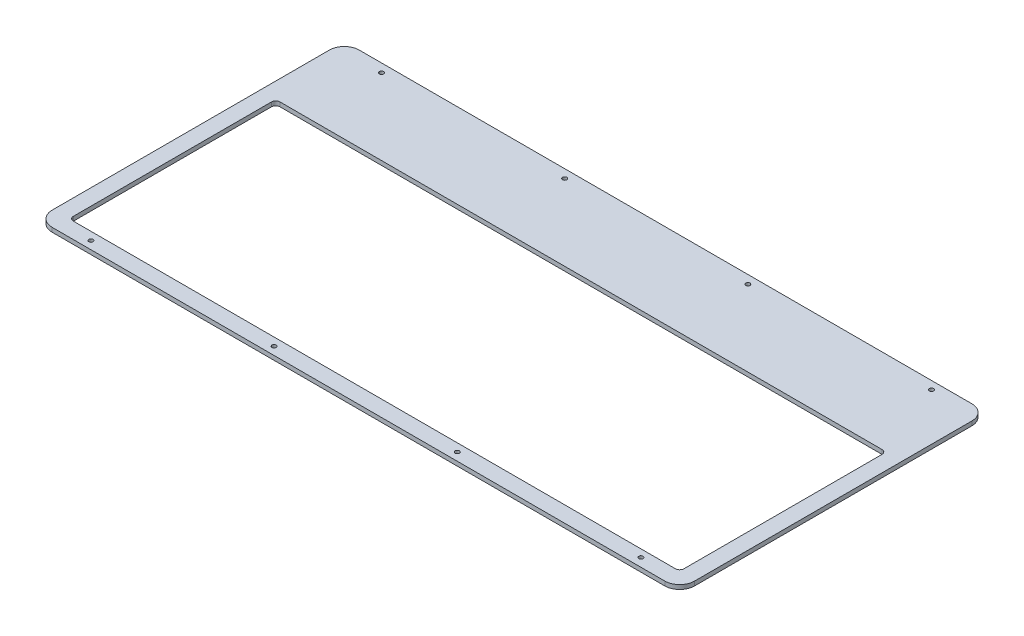
ISO-10303-21;
HEADER;
FILE_DESCRIPTION(('STEP AP214'),'2;1');
FILE_NAME('part.step','',(''),(''),'','','');
FILE_SCHEMA(('AUTOMOTIVE_DESIGN { 1 0 10303 214 1 1 1 1 }'));
ENDSEC;
DATA;
#1=APPLICATION_CONTEXT('core data for automotive mechanical design processes');
#2=APPLICATION_PROTOCOL_DEFINITION('international standard','automotive_design',2000,#1);
#3=PRODUCT_CONTEXT('',#1,'mechanical');
#4=PRODUCT('Part','Part','',(#3));
#5=PRODUCT_RELATED_PRODUCT_CATEGORY('part','',(#4));
#6=PRODUCT_DEFINITION_FORMATION('','',#4);
#7=PRODUCT_DEFINITION_CONTEXT('part definition',#1,'design');
#8=PRODUCT_DEFINITION('design','',#6,#7);
#9=PRODUCT_DEFINITION_SHAPE('','',#8);
#10=(LENGTH_UNIT() NAMED_UNIT(*) SI_UNIT(.MILLI.,.METRE.));
#11=(NAMED_UNIT(*) PLANE_ANGLE_UNIT() SI_UNIT($,.RADIAN.));
#12=(NAMED_UNIT(*) SI_UNIT($,.STERADIAN.) SOLID_ANGLE_UNIT());
#13=UNCERTAINTY_MEASURE_WITH_UNIT(LENGTH_MEASURE(1.E-05),#10,'distance_accuracy_value','');
#14=(GEOMETRIC_REPRESENTATION_CONTEXT(3) GLOBAL_UNCERTAINTY_ASSIGNED_CONTEXT((#13)) GLOBAL_UNIT_ASSIGNED_CONTEXT((#10,
#11,#12)) REPRESENTATION_CONTEXT('',''));
#15=CARTESIAN_POINT('',(0.,0.,0.));
#16=DIRECTION('',(0.,0.,1.));
#17=DIRECTION('',(1.,0.,0.));
#18=AXIS2_PLACEMENT_3D('',#15,#16,#17);
#19=CARTESIAN_POINT('',(0.,0.,0.));
#20=DIRECTION('',(0.,-1.,0.));
#21=DIRECTION('',(0.,0.,-1.));
#22=AXIS2_PLACEMENT_3D('',#19,#20,#21);
#23=PLANE('',#22);
#24=CARTESIAN_POINT('',(42.1224134617498,0.,-172.436764678539));
#25=DIRECTION('',(0.,-1.,0.));
#26=DIRECTION('',(0.,0.,-1.));
#27=AXIS2_PLACEMENT_3D('',#24,#25,#26);
#28=CIRCLE('',#27,1.);
#29=CARTESIAN_POINT('',(42.1224134617498,0.,-173.436764678539));
#30=VERTEX_POINT('',#29);
#31=EDGE_CURVE('E45',#30,#30,#28,.T.);
#32=ORIENTED_EDGE('',*,*,#31,.F.);
#33=EDGE_LOOP('',(#32));
#34=FACE_BOUND('',#33,.T.);
#35=CARTESIAN_POINT('',(128.12241346175,0.,-172.436764678539));
#36=DIRECTION('',(0.,-1.,0.));
#37=DIRECTION('',(0.,0.,-1.));
#38=AXIS2_PLACEMENT_3D('',#35,#36,#37);
#39=CIRCLE('',#38,1.);
#40=CARTESIAN_POINT('',(128.12241346175,0.,-173.436764678539));
#41=VERTEX_POINT('',#40);
#42=EDGE_CURVE('E320',#41,#41,#39,.T.);
#43=ORIENTED_EDGE('',*,*,#42,.F.);
#44=EDGE_LOOP('',(#43));
#45=FACE_BOUND('',#44,.T.);
#46=CARTESIAN_POINT('',(214.12241346175,0.,-172.436764678539));
#47=DIRECTION('',(0.,-1.,0.));
#48=DIRECTION('',(0.,0.,-1.));
#49=AXIS2_PLACEMENT_3D('',#46,#47,#48);
#50=CIRCLE('',#49,1.);
#51=CARTESIAN_POINT('',(214.12241346175,0.,-173.436764678539));
#52=VERTEX_POINT('',#51);
#53=EDGE_CURVE('E318',#52,#52,#50,.T.);
#54=ORIENTED_EDGE('',*,*,#53,.F.);
#55=EDGE_LOOP('',(#54));
#56=FACE_BOUND('',#55,.T.);
#57=CARTESIAN_POINT('',(300.12241346175,0.,-172.686764678539));
#58=DIRECTION('',(0.,-1.,0.));
#59=DIRECTION('',(0.,0.,-1.));
#60=AXIS2_PLACEMENT_3D('',#57,#58,#59);
#61=CIRCLE('',#60,1.);
#62=CARTESIAN_POINT('',(300.12241346175,0.,-173.686764678539));
#63=VERTEX_POINT('',#62);
#64=EDGE_CURVE('E315',#63,#63,#61,.T.);
#65=ORIENTED_EDGE('',*,*,#64,.F.);
#66=EDGE_LOOP('',(#65));
#67=FACE_BOUND('',#66,.T.);
#68=CARTESIAN_POINT('',(300.12241346175,0.,-36.2373046785389));
#69=DIRECTION('',(0.,-1.,0.));
#70=DIRECTION('',(0.,0.,-1.));
#71=AXIS2_PLACEMENT_3D('',#68,#69,#70);
#72=CIRCLE('',#71,1.);
#73=CARTESIAN_POINT('',(300.12241346175,0.,-37.2373046785389));
#74=VERTEX_POINT('',#73);
#75=EDGE_CURVE('E312',#74,#74,#72,.T.);
#76=ORIENTED_EDGE('',*,*,#75,.F.);
#77=EDGE_LOOP('',(#76));
#78=FACE_BOUND('',#77,.T.);
#79=CARTESIAN_POINT('',(214.12241346175,0.,-35.9873046785389));
#80=DIRECTION('',(0.,-1.,0.));
#81=DIRECTION('',(0.,0.,-1.));
#82=AXIS2_PLACEMENT_3D('',#79,#80,#81);
#83=CIRCLE('',#82,1.);
#84=CARTESIAN_POINT('',(214.12241346175,0.,-36.9873046785389));
#85=VERTEX_POINT('',#84);
#86=EDGE_CURVE('E309',#85,#85,#83,.T.);
#87=ORIENTED_EDGE('',*,*,#86,.F.);
#88=EDGE_LOOP('',(#87));
#89=FACE_BOUND('',#88,.T.);
#90=CARTESIAN_POINT('',(128.12241346175,0.,-35.9873046785389));
#91=DIRECTION('',(0.,-1.,0.));
#92=DIRECTION('',(0.,0.,-1.));
#93=AXIS2_PLACEMENT_3D('',#90,#91,#92);
#94=CIRCLE('',#93,1.);
#95=CARTESIAN_POINT('',(128.12241346175,0.,-36.9873046785389));
#96=VERTEX_POINT('',#95);
#97=EDGE_CURVE('E306',#96,#96,#94,.T.);
#98=ORIENTED_EDGE('',*,*,#97,.F.);
#99=EDGE_LOOP('',(#98));
#100=FACE_BOUND('',#99,.T.);
#101=CARTESIAN_POINT('',(42.1224134617498,0.,-35.9873046785389));
#102=DIRECTION('',(0.,-1.,0.));
#103=DIRECTION('',(0.,0.,-1.));
#104=AXIS2_PLACEMENT_3D('',#101,#102,#103);
#105=CIRCLE('',#104,1.);
#106=CARTESIAN_POINT('',(42.1224134617498,0.,-36.9873046785389));
#107=VERTEX_POINT('',#106);
#108=EDGE_CURVE('E256',#107,#107,#105,.T.);
#109=ORIENTED_EDGE('',*,*,#108,.F.);
#110=EDGE_LOOP('',(#109));
#111=FACE_BOUND('',#110,.T.);
#112=CARTESIAN_POINT('',(312.82176346175,0.,-41.7373046785389));
#113=DIRECTION('',(0.,-1.,0.));
#114=DIRECTION('',(0.,0.,-1.));
#115=AXIS2_PLACEMENT_3D('',#112,#113,#114);
#116=CIRCLE('',#115,2.);
#117=CARTESIAN_POINT('',(314.82176346175,0.,-41.7373046785389));
#118=VERTEX_POINT('',#117);
#119=CARTESIAN_POINT('',(312.82176346175,0.,-39.7373046785389));
#120=VERTEX_POINT('',#119);
#121=EDGE_CURVE('E285',#118,#120,#116,.T.);
#122=ORIENTED_EDGE('',*,*,#121,.F.);
#123=DIRECTION('',(0.,0.,1.));
#124=VECTOR('',#123,1.);
#125=CARTESIAN_POINT('',(314.82176346175,0.,0.));
#126=LINE('',#125,#124);
#127=CARTESIAN_POINT('',(314.82176346175,0.,-134.737304678539));
#128=VERTEX_POINT('',#127);
#129=EDGE_CURVE('E270',#128,#118,#126,.T.);
#130=ORIENTED_EDGE('',*,*,#129,.F.);
#131=CARTESIAN_POINT('',(312.82176346175,0.,-134.737304678539));
#132=DIRECTION('',(0.,-1.,0.));
#133=DIRECTION('',(0.,0.,-1.));
#134=AXIS2_PLACEMENT_3D('',#131,#132,#133);
#135=CIRCLE('',#134,2.);
#136=CARTESIAN_POINT('',(312.82176346175,0.,-136.737304678539));
#137=VERTEX_POINT('',#136);
#138=EDGE_CURVE('E272',#137,#128,#135,.T.);
#139=ORIENTED_EDGE('',*,*,#138,.F.);
#140=DIRECTION('',(1.,0.,0.));
#141=VECTOR('',#140,1.);
#142=CARTESIAN_POINT('',(0.,0.,-136.737304678539));
#143=LINE('',#142,#141);
#144=CARTESIAN_POINT('',(30.1224134617498,0.,-136.737304678539));
#145=VERTEX_POINT('',#144);
#146=EDGE_CURVE('E275',#145,#137,#143,.T.);
#147=ORIENTED_EDGE('',*,*,#146,.F.);
#148=CARTESIAN_POINT('',(30.1224134617498,0.,-134.737304678539));
#149=DIRECTION('',(0.,-1.,0.));
#150=DIRECTION('',(0.,0.,-1.));
#151=AXIS2_PLACEMENT_3D('',#148,#149,#150);
#152=CIRCLE('',#151,2.);
#153=CARTESIAN_POINT('',(28.1224134617498,0.,-134.737304678539));
#154=VERTEX_POINT('',#153);
#155=EDGE_CURVE('E277',#154,#145,#152,.T.);
#156=ORIENTED_EDGE('',*,*,#155,.F.);
#157=DIRECTION('',(0.,0.,-1.));
#158=VECTOR('',#157,1.);
#159=CARTESIAN_POINT('',(28.1224134617498,0.,0.));
#160=LINE('',#159,#158);
#161=CARTESIAN_POINT('',(28.1224134617498,0.,-41.7373046785389));
#162=VERTEX_POINT('',#161);
#163=EDGE_CURVE('E279',#162,#154,#160,.T.);
#164=ORIENTED_EDGE('',*,*,#163,.F.);
#165=CARTESIAN_POINT('',(30.1224134617498,0.,-41.7373046785389));
#166=DIRECTION('',(0.,-1.,0.));
#167=DIRECTION('',(0.,0.,-1.));
#168=AXIS2_PLACEMENT_3D('',#165,#166,#167);
#169=CIRCLE('',#168,2.);
#170=CARTESIAN_POINT('',(30.1224134617498,0.,-39.7373046785389));
#171=VERTEX_POINT('',#170);
#172=EDGE_CURVE('E281',#171,#162,#169,.T.);
#173=ORIENTED_EDGE('',*,*,#172,.F.);
#174=DIRECTION('',(-1.,0.,0.));
#175=VECTOR('',#174,1.);
#176=CARTESIAN_POINT('',(0.,0.,-39.7373046785389));
#177=LINE('',#176,#175);
#178=EDGE_CURVE('E283',#120,#171,#177,.T.);
#179=ORIENTED_EDGE('',*,*,#178,.F.);
#180=EDGE_LOOP('',(#122,#130,#139,#147,#156,#164,#173,#179));
#181=FACE_BOUND('',#180,.T.);
#182=DIRECTION('',(0.,0.,-1.));
#183=VECTOR('',#182,1.);
#184=CARTESIAN_POINT('',(20.6224134617498,0.,0.));
#185=LINE('',#184,#183);
#186=CARTESIAN_POINT('',(20.6224134617498,0.,-39.2373046785389));
#187=VERTEX_POINT('',#186);
#188=CARTESIAN_POINT('',(20.6224134617498,0.,-169.436764678539));
#189=VERTEX_POINT('',#188);
#190=EDGE_CURVE('E287',#187,#189,#185,.T.);
#191=ORIENTED_EDGE('',*,*,#190,.T.);
#192=CARTESIAN_POINT('',(27.6224134617498,0.,-169.436764678539));
#193=DIRECTION('',(0.,-1.,0.));
#194=DIRECTION('',(0.,0.,-1.));
#195=AXIS2_PLACEMENT_3D('',#192,#193,#194);
#196=CIRCLE('',#195,7.);
#197=CARTESIAN_POINT('',(27.6224134617498,0.,-176.436764678539));
#198=VERTEX_POINT('',#197);
#199=EDGE_CURVE('E12',#189,#198,#196,.T.);
#200=ORIENTED_EDGE('',*,*,#199,.T.);
#201=DIRECTION('',(1.,0.,0.));
#202=VECTOR('',#201,1.);
#203=CARTESIAN_POINT('',(0.,0.,-176.436764678539));
#204=LINE('',#203,#202);
#205=CARTESIAN_POINT('',(315.32176346175,0.,-176.436764678539));
#206=VERTEX_POINT('',#205);
#207=EDGE_CURVE('E50',#198,#206,#204,.T.);
#208=ORIENTED_EDGE('',*,*,#207,.T.);
#209=CARTESIAN_POINT('',(315.32176346175,0.,-169.436764678539));
#210=DIRECTION('',(0.,-1.,0.));
#211=DIRECTION('',(0.,0.,-1.));
#212=AXIS2_PLACEMENT_3D('',#209,#210,#211);
#213=CIRCLE('',#212,7.00000000000001);
#214=CARTESIAN_POINT('',(322.32176346175,0.,-169.436764678539));
#215=VERTEX_POINT('',#214);
#216=EDGE_CURVE('E299',#206,#215,#213,.T.);
#217=ORIENTED_EDGE('',*,*,#216,.T.);
#218=DIRECTION('',(0.,0.,1.));
#219=VECTOR('',#218,1.);
#220=CARTESIAN_POINT('',(322.32176346175,0.,0.));
#221=LINE('',#220,#219);
#222=CARTESIAN_POINT('',(322.32176346175,0.,-39.2373046785389));
#223=VERTEX_POINT('',#222);
#224=EDGE_CURVE('E296',#215,#223,#221,.T.);
#225=ORIENTED_EDGE('',*,*,#224,.T.);
#226=CARTESIAN_POINT('',(315.32176346175,0.,-39.2373046785389));
#227=DIRECTION('',(0.,-1.,0.));
#228=DIRECTION('',(0.,0.,-1.));
#229=AXIS2_PLACEMENT_3D('',#226,#227,#228);
#230=CIRCLE('',#229,7.);
#231=CARTESIAN_POINT('',(315.32176346175,0.,-32.2373046785389));
#232=VERTEX_POINT('',#231);
#233=EDGE_CURVE('E293',#223,#232,#230,.T.);
#234=ORIENTED_EDGE('',*,*,#233,.T.);
#235=DIRECTION('',(-1.,0.,0.));
#236=VECTOR('',#235,1.);
#237=CARTESIAN_POINT('',(0.,0.,-32.2373046785389));
#238=LINE('',#237,#236);
#239=CARTESIAN_POINT('',(27.6224134617498,0.,-32.2373046785389));
#240=VERTEX_POINT('',#239);
#241=EDGE_CURVE('E291',#232,#240,#238,.T.);
#242=ORIENTED_EDGE('',*,*,#241,.T.);
#243=CARTESIAN_POINT('',(27.6224134617498,0.,-39.2373046785389));
#244=DIRECTION('',(0.,-1.,0.));
#245=DIRECTION('',(0.,0.,-1.));
#246=AXIS2_PLACEMENT_3D('',#243,#244,#245);
#247=CIRCLE('',#246,7.);
#248=EDGE_CURVE('E160',#240,#187,#247,.T.);
#249=ORIENTED_EDGE('',*,*,#248,.T.);
#250=EDGE_LOOP('',(#191,#200,#208,#217,#225,#234,#242,#249));
#251=FACE_BOUND('',#250,.T.);
#252=ADVANCED_FACE('F42',(#34,#45,#56,#67,#78,#89,#100,#111,#181,#251),#23,.T.);
#253=CARTESIAN_POINT('',(312.82176346175,-8.,-41.7373046785389));
#254=DIRECTION('',(0.,1.,0.));
#255=DIRECTION('',(0.,0.,1.));
#256=AXIS2_PLACEMENT_3D('',#253,#254,#255);
#257=CYLINDRICAL_SURFACE('',#256,2.);
#258=ORIENTED_EDGE('',*,*,#121,.T.);
#259=DIRECTION('',(0.,1.,0.));
#260=VECTOR('',#259,1.);
#261=CARTESIAN_POINT('',(312.82176346175,-8.,-39.7373046785389));
#262=LINE('',#261,#260);
#263=CARTESIAN_POINT('',(312.82176346175,2.,-39.7373046785389));
#264=VERTEX_POINT('',#263);
#265=EDGE_CURVE('E254',#120,#264,#262,.T.);
#266=ORIENTED_EDGE('',*,*,#265,.T.);
#267=CARTESIAN_POINT('',(312.82176346175,2.,-41.7373046785389));
#268=DIRECTION('',(0.,1.,0.));
#269=DIRECTION('',(0.,0.,1.));
#270=AXIS2_PLACEMENT_3D('',#267,#268,#269);
#271=CIRCLE('',#270,2.);
#272=CARTESIAN_POINT('',(314.82176346175,2.,-41.7373046785389));
#273=VERTEX_POINT('',#272);
#274=EDGE_CURVE('E66',#264,#273,#271,.T.);
#275=ORIENTED_EDGE('',*,*,#274,.T.);
#276=DIRECTION('',(0.,1.,0.));
#277=VECTOR('',#276,1.);
#278=CARTESIAN_POINT('',(314.82176346175,-8.,-41.7373046785389));
#279=LINE('',#278,#277);
#280=EDGE_CURVE('E253',#118,#273,#279,.T.);
#281=ORIENTED_EDGE('',*,*,#280,.F.);
#282=EDGE_LOOP('',(#258,#266,#275,#281));
#283=FACE_BOUND('',#282,.T.);
#284=ADVANCED_FACE('F332',(#283),#257,.F.);
#285=CARTESIAN_POINT('',(312.82176346175,-8.,-39.7373046785389));
#286=DIRECTION('',(0.,0.,1.));
#287=DIRECTION('',(1.,0.,0.));
#288=AXIS2_PLACEMENT_3D('',#285,#286,#287);
#289=PLANE('',#288);
#290=ORIENTED_EDGE('',*,*,#178,.T.);
#291=DIRECTION('',(0.,1.,0.));
#292=VECTOR('',#291,1.);
#293=CARTESIAN_POINT('',(30.1224134617498,-8.,-39.7373046785389));
#294=LINE('',#293,#292);
#295=CARTESIAN_POINT('',(30.1224134617498,2.,-39.7373046785389));
#296=VERTEX_POINT('',#295);
#297=EDGE_CURVE('E257',#171,#296,#294,.T.);
#298=ORIENTED_EDGE('',*,*,#297,.T.);
#299=DIRECTION('',(1.,0.,0.));
#300=VECTOR('',#299,1.);
#301=CARTESIAN_POINT('',(312.82176346175,2.,-39.7373046785389));
#302=LINE('',#301,#300);
#303=EDGE_CURVE('E250',#296,#264,#302,.T.);
#304=ORIENTED_EDGE('',*,*,#303,.T.);
#305=ORIENTED_EDGE('',*,*,#265,.F.);
#306=EDGE_LOOP('',(#290,#298,#304,#305));
#307=FACE_BOUND('',#306,.T.);
#308=ADVANCED_FACE('F417',(#307),#289,.F.);
#309=CARTESIAN_POINT('',(30.1224134617498,-8.,-41.7373046785389));
#310=DIRECTION('',(0.,1.,0.));
#311=DIRECTION('',(0.,0.,1.));
#312=AXIS2_PLACEMENT_3D('',#309,#310,#311);
#313=CYLINDRICAL_SURFACE('',#312,2.);
#314=ORIENTED_EDGE('',*,*,#172,.T.);
#315=DIRECTION('',(0.,1.,0.));
#316=VECTOR('',#315,1.);
#317=CARTESIAN_POINT('',(28.1224134617498,-8.,-41.7373046785389));
#318=LINE('',#317,#316);
#319=CARTESIAN_POINT('',(28.1224134617498,2.,-41.7373046785389));
#320=VERTEX_POINT('',#319);
#321=EDGE_CURVE('E259',#162,#320,#318,.T.);
#322=ORIENTED_EDGE('',*,*,#321,.T.);
#323=CARTESIAN_POINT('',(30.1224134617498,2.,-41.7373046785389));
#324=DIRECTION('',(0.,1.,0.));
#325=DIRECTION('',(0.,0.,1.));
#326=AXIS2_PLACEMENT_3D('',#323,#324,#325);
#327=CIRCLE('',#326,2.);
#328=EDGE_CURVE('E247',#320,#296,#327,.T.);
#329=ORIENTED_EDGE('',*,*,#328,.T.);
#330=ORIENTED_EDGE('',*,*,#297,.F.);
#331=EDGE_LOOP('',(#314,#322,#329,#330));
#332=FACE_BOUND('',#331,.T.);
#333=ADVANCED_FACE('F420',(#332),#313,.F.);
#334=CARTESIAN_POINT('',(28.1224134617498,-8.,-41.7373046785389));
#335=DIRECTION('',(-1.,0.,0.));
#336=DIRECTION('',(0.,0.,1.));
#337=AXIS2_PLACEMENT_3D('',#334,#335,#336);
#338=PLANE('',#337);
#339=ORIENTED_EDGE('',*,*,#163,.T.);
#340=DIRECTION('',(0.,1.,0.));
#341=VECTOR('',#340,1.);
#342=CARTESIAN_POINT('',(28.1224134617498,-8.,-134.737304678539));
#343=LINE('',#342,#341);
#344=CARTESIAN_POINT('',(28.1224134617498,2.,-134.737304678539));
#345=VERTEX_POINT('',#344);
#346=EDGE_CURVE('E261',#154,#345,#343,.T.);
#347=ORIENTED_EDGE('',*,*,#346,.T.);
#348=DIRECTION('',(0.,0.,1.));
#349=VECTOR('',#348,1.);
#350=CARTESIAN_POINT('',(28.1224134617498,2.,-41.7373046785389));
#351=LINE('',#350,#349);
#352=EDGE_CURVE('E244',#345,#320,#351,.T.);
#353=ORIENTED_EDGE('',*,*,#352,.T.);
#354=ORIENTED_EDGE('',*,*,#321,.F.);
#355=EDGE_LOOP('',(#339,#347,#353,#354));
#356=FACE_BOUND('',#355,.T.);
#357=ADVANCED_FACE('F424',(#356),#338,.F.);
#358=CARTESIAN_POINT('',(30.1224134617498,-8.,-134.737304678539));
#359=DIRECTION('',(0.,1.,0.));
#360=DIRECTION('',(0.,0.,1.));
#361=AXIS2_PLACEMENT_3D('',#358,#359,#360);
#362=CYLINDRICAL_SURFACE('',#361,2.);
#363=ORIENTED_EDGE('',*,*,#155,.T.);
#364=DIRECTION('',(0.,1.,0.));
#365=VECTOR('',#364,1.);
#366=CARTESIAN_POINT('',(30.1224134617498,-8.,-136.737304678539));
#367=LINE('',#366,#365);
#368=CARTESIAN_POINT('',(30.1224134617498,2.,-136.737304678539));
#369=VERTEX_POINT('',#368);
#370=EDGE_CURVE('E263',#145,#369,#367,.T.);
#371=ORIENTED_EDGE('',*,*,#370,.T.);
#372=CARTESIAN_POINT('',(30.1224134617498,2.,-134.737304678539));
#373=DIRECTION('',(0.,1.,0.));
#374=DIRECTION('',(0.,0.,1.));
#375=AXIS2_PLACEMENT_3D('',#372,#373,#374);
#376=CIRCLE('',#375,2.);
#377=EDGE_CURVE('E241',#369,#345,#376,.T.);
#378=ORIENTED_EDGE('',*,*,#377,.T.);
#379=ORIENTED_EDGE('',*,*,#346,.F.);
#380=EDGE_LOOP('',(#363,#371,#378,#379));
#381=FACE_BOUND('',#380,.T.);
#382=ADVANCED_FACE('F428',(#381),#362,.F.);
#383=CARTESIAN_POINT('',(30.1224134617498,-8.,-136.737304678539));
#384=DIRECTION('',(0.,0.,-1.));
#385=DIRECTION('',(-1.,0.,0.));
#386=AXIS2_PLACEMENT_3D('',#383,#384,#385);
#387=PLANE('',#386);
#388=ORIENTED_EDGE('',*,*,#146,.T.);
#389=DIRECTION('',(0.,1.,0.));
#390=VECTOR('',#389,1.);
#391=CARTESIAN_POINT('',(312.82176346175,-8.,-136.737304678539));
#392=LINE('',#391,#390);
#393=CARTESIAN_POINT('',(312.82176346175,2.,-136.737304678539));
#394=VERTEX_POINT('',#393);
#395=EDGE_CURVE('E265',#137,#394,#392,.T.);
#396=ORIENTED_EDGE('',*,*,#395,.T.);
#397=DIRECTION('',(-1.,0.,0.));
#398=VECTOR('',#397,1.);
#399=CARTESIAN_POINT('',(30.1224134617498,2.,-136.737304678539));
#400=LINE('',#399,#398);
#401=EDGE_CURVE('E238',#394,#369,#400,.T.);
#402=ORIENTED_EDGE('',*,*,#401,.T.);
#403=ORIENTED_EDGE('',*,*,#370,.F.);
#404=EDGE_LOOP('',(#388,#396,#402,#403));
#405=FACE_BOUND('',#404,.T.);
#406=ADVANCED_FACE('F432',(#405),#387,.F.);
#407=CARTESIAN_POINT('',(312.82176346175,-8.,-134.737304678539));
#408=DIRECTION('',(0.,1.,0.));
#409=DIRECTION('',(0.,0.,1.));
#410=AXIS2_PLACEMENT_3D('',#407,#408,#409);
#411=CYLINDRICAL_SURFACE('',#410,2.);
#412=ORIENTED_EDGE('',*,*,#138,.T.);
#413=DIRECTION('',(0.,1.,0.));
#414=VECTOR('',#413,1.);
#415=CARTESIAN_POINT('',(314.82176346175,-8.,-134.737304678539));
#416=LINE('',#415,#414);
#417=CARTESIAN_POINT('',(314.82176346175,2.,-134.737304678539));
#418=VERTEX_POINT('',#417);
#419=EDGE_CURVE('E267',#128,#418,#416,.T.);
#420=ORIENTED_EDGE('',*,*,#419,.T.);
#421=CARTESIAN_POINT('',(312.82176346175,2.,-134.737304678539));
#422=DIRECTION('',(0.,1.,0.));
#423=DIRECTION('',(0.,0.,1.));
#424=AXIS2_PLACEMENT_3D('',#421,#422,#423);
#425=CIRCLE('',#424,2.);
#426=EDGE_CURVE('E235',#418,#394,#425,.T.);
#427=ORIENTED_EDGE('',*,*,#426,.T.);
#428=ORIENTED_EDGE('',*,*,#395,.F.);
#429=EDGE_LOOP('',(#412,#420,#427,#428));
#430=FACE_BOUND('',#429,.T.);
#431=ADVANCED_FACE('F436',(#430),#411,.F.);
#432=CARTESIAN_POINT('',(314.82176346175,-8.,-41.7373046785389));
#433=DIRECTION('',(1.,0.,0.));
#434=DIRECTION('',(0.,0.,-1.));
#435=AXIS2_PLACEMENT_3D('',#432,#433,#434);
#436=PLANE('',#435);
#437=ORIENTED_EDGE('',*,*,#129,.T.);
#438=ORIENTED_EDGE('',*,*,#280,.T.);
#439=DIRECTION('',(0.,0.,-1.));
#440=VECTOR('',#439,1.);
#441=CARTESIAN_POINT('',(314.82176346175,2.,-41.7373046785389));
#442=LINE('',#441,#440);
#443=EDGE_CURVE('E232',#273,#418,#442,.T.);
#444=ORIENTED_EDGE('',*,*,#443,.T.);
#445=ORIENTED_EDGE('',*,*,#419,.F.);
#446=EDGE_LOOP('',(#437,#438,#444,#445));
#447=FACE_BOUND('',#446,.T.);
#448=ADVANCED_FACE('F388',(#447),#436,.F.);
#449=CARTESIAN_POINT('',(27.6224134617498,-8.,-169.436764678539));
#450=DIRECTION('',(0.,1.,0.));
#451=DIRECTION('',(0.,0.,1.));
#452=AXIS2_PLACEMENT_3D('',#449,#450,#451);
#453=CYLINDRICAL_SURFACE('',#452,7.);
#454=DIRECTION('',(0.,1.,0.));
#455=VECTOR('',#454,1.);
#456=CARTESIAN_POINT('',(20.6224134617498,-8.,-169.436764678539));
#457=LINE('',#456,#455);
#458=CARTESIAN_POINT('',(20.6224134617498,2.,-169.436764678539));
#459=VERTEX_POINT('',#458);
#460=EDGE_CURVE('E195',#189,#459,#457,.T.);
#461=ORIENTED_EDGE('',*,*,#460,.T.);
#462=CARTESIAN_POINT('',(27.6224134617498,2.,-169.436764678539));
#463=DIRECTION('',(0.,1.,0.));
#464=DIRECTION('',(0.,0.,1.));
#465=AXIS2_PLACEMENT_3D('',#462,#463,#464);
#466=CIRCLE('',#465,7.);
#467=CARTESIAN_POINT('',(27.6224134617498,2.,-176.436764678539));
#468=VERTEX_POINT('',#467);
#469=EDGE_CURVE('E181',#468,#459,#466,.T.);
#470=ORIENTED_EDGE('',*,*,#469,.F.);
#471=DIRECTION('',(0.,1.,0.));
#472=VECTOR('',#471,1.);
#473=CARTESIAN_POINT('',(27.6224134617498,-8.,-176.436764678539));
#474=LINE('',#473,#472);
#475=EDGE_CURVE('E196',#198,#468,#474,.T.);
#476=ORIENTED_EDGE('',*,*,#475,.F.);
#477=ORIENTED_EDGE('',*,*,#199,.F.);
#478=EDGE_LOOP('',(#461,#470,#476,#477));
#479=FACE_BOUND('',#478,.T.);
#480=ADVANCED_FACE('F356',(#479),#453,.T.);
#481=CARTESIAN_POINT('',(27.6224134617498,-8.,-176.436764678539));
#482=DIRECTION('',(0.,0.,-1.));
#483=DIRECTION('',(-1.,0.,0.));
#484=AXIS2_PLACEMENT_3D('',#481,#482,#483);
#485=PLANE('',#484);
#486=ORIENTED_EDGE('',*,*,#475,.T.);
#487=DIRECTION('',(-1.,0.,0.));
#488=VECTOR('',#487,1.);
#489=CARTESIAN_POINT('',(27.6224134617498,2.,-176.436764678539));
#490=LINE('',#489,#488);
#491=CARTESIAN_POINT('',(315.32176346175,2.,-176.436764678539));
#492=VERTEX_POINT('',#491);
#493=EDGE_CURVE('E192',#492,#468,#490,.T.);
#494=ORIENTED_EDGE('',*,*,#493,.F.);
#495=DIRECTION('',(0.,1.,0.));
#496=VECTOR('',#495,1.);
#497=CARTESIAN_POINT('',(315.32176346175,-8.,-176.436764678539));
#498=LINE('',#497,#496);
#499=EDGE_CURVE('E199',#206,#492,#498,.T.);
#500=ORIENTED_EDGE('',*,*,#499,.F.);
#501=ORIENTED_EDGE('',*,*,#207,.F.);
#502=EDGE_LOOP('',(#486,#494,#500,#501));
#503=FACE_BOUND('',#502,.T.);
#504=ADVANCED_FACE('F359',(#503),#485,.T.);
#505=CARTESIAN_POINT('',(315.32176346175,-8.,-169.436764678539));
#506=DIRECTION('',(0.,1.,0.));
#507=DIRECTION('',(0.,0.,1.));
#508=AXIS2_PLACEMENT_3D('',#505,#506,#507);
#509=CYLINDRICAL_SURFACE('',#508,7.00000000000001);
#510=ORIENTED_EDGE('',*,*,#499,.T.);
#511=CARTESIAN_POINT('',(315.32176346175,2.,-169.436764678539));
#512=DIRECTION('',(0.,1.,0.));
#513=DIRECTION('',(0.,0.,1.));
#514=AXIS2_PLACEMENT_3D('',#511,#512,#513);
#515=CIRCLE('',#514,7.00000000000001);
#516=CARTESIAN_POINT('',(322.32176346175,2.,-169.436764678539));
#517=VERTEX_POINT('',#516);
#518=EDGE_CURVE('E189',#517,#492,#515,.T.);
#519=ORIENTED_EDGE('',*,*,#518,.F.);
#520=DIRECTION('',(0.,1.,0.));
#521=VECTOR('',#520,1.);
#522=CARTESIAN_POINT('',(322.32176346175,-8.,-169.436764678539));
#523=LINE('',#522,#521);
#524=EDGE_CURVE('E201',#215,#517,#523,.T.);
#525=ORIENTED_EDGE('',*,*,#524,.F.);
#526=ORIENTED_EDGE('',*,*,#216,.F.);
#527=EDGE_LOOP('',(#510,#519,#525,#526));
#528=FACE_BOUND('',#527,.T.);
#529=ADVANCED_FACE('F363',(#528),#509,.T.);
#530=CARTESIAN_POINT('',(322.32176346175,-8.,-169.436764678539));
#531=DIRECTION('',(1.,0.,0.));
#532=DIRECTION('',(0.,0.,-1.));
#533=AXIS2_PLACEMENT_3D('',#530,#531,#532);
#534=PLANE('',#533);
#535=ORIENTED_EDGE('',*,*,#524,.T.);
#536=DIRECTION('',(0.,0.,-1.));
#537=VECTOR('',#536,1.);
#538=CARTESIAN_POINT('',(322.32176346175,2.,-169.436764678539));
#539=LINE('',#538,#537);
#540=CARTESIAN_POINT('',(322.32176346175,2.,-39.2373046785389));
#541=VERTEX_POINT('',#540);
#542=EDGE_CURVE('E186',#541,#517,#539,.T.);
#543=ORIENTED_EDGE('',*,*,#542,.F.);
#544=DIRECTION('',(0.,1.,0.));
#545=VECTOR('',#544,1.);
#546=CARTESIAN_POINT('',(322.32176346175,-8.,-39.2373046785389));
#547=LINE('',#546,#545);
#548=EDGE_CURVE('E203',#223,#541,#547,.T.);
#549=ORIENTED_EDGE('',*,*,#548,.F.);
#550=ORIENTED_EDGE('',*,*,#224,.F.);
#551=EDGE_LOOP('',(#535,#543,#549,#550));
#552=FACE_BOUND('',#551,.T.);
#553=ADVANCED_FACE('F367',(#552),#534,.T.);
#554=CARTESIAN_POINT('',(315.32176346175,-8.,-39.2373046785389));
#555=DIRECTION('',(0.,1.,0.));
#556=DIRECTION('',(0.,0.,1.));
#557=AXIS2_PLACEMENT_3D('',#554,#555,#556);
#558=CYLINDRICAL_SURFACE('',#557,7.);
#559=ORIENTED_EDGE('',*,*,#548,.T.);
#560=CARTESIAN_POINT('',(315.32176346175,2.,-39.2373046785389));
#561=DIRECTION('',(0.,1.,0.));
#562=DIRECTION('',(0.,0.,1.));
#563=AXIS2_PLACEMENT_3D('',#560,#561,#562);
#564=CIRCLE('',#563,7.);
#565=CARTESIAN_POINT('',(315.32176346175,2.,-32.2373046785389));
#566=VERTEX_POINT('',#565);
#567=EDGE_CURVE('E173',#566,#541,#564,.T.);
#568=ORIENTED_EDGE('',*,*,#567,.F.);
#569=DIRECTION('',(0.,1.,0.));
#570=VECTOR('',#569,1.);
#571=CARTESIAN_POINT('',(315.32176346175,-8.,-32.2373046785389));
#572=LINE('',#571,#570);
#573=EDGE_CURVE('E163',#232,#566,#572,.T.);
#574=ORIENTED_EDGE('',*,*,#573,.F.);
#575=ORIENTED_EDGE('',*,*,#233,.F.);
#576=EDGE_LOOP('',(#559,#568,#574,#575));
#577=FACE_BOUND('',#576,.T.);
#578=ADVANCED_FACE('F370',(#577),#558,.T.);
#579=CARTESIAN_POINT('',(315.32176346175,-8.,-32.2373046785389));
#580=DIRECTION('',(0.,0.,1.));
#581=DIRECTION('',(1.,0.,0.));
#582=AXIS2_PLACEMENT_3D('',#579,#580,#581);
#583=PLANE('',#582);
#584=ORIENTED_EDGE('',*,*,#573,.T.);
#585=DIRECTION('',(1.,0.,0.));
#586=VECTOR('',#585,1.);
#587=CARTESIAN_POINT('',(315.32176346175,2.,-32.2373046785389));
#588=LINE('',#587,#586);
#589=CARTESIAN_POINT('',(27.6224134617498,2.,-32.2373046785389));
#590=VERTEX_POINT('',#589);
#591=EDGE_CURVE('E167',#590,#566,#588,.T.);
#592=ORIENTED_EDGE('',*,*,#591,.F.);
#593=DIRECTION('',(0.,1.,0.));
#594=VECTOR('',#593,1.);
#595=CARTESIAN_POINT('',(27.6224134617498,-8.,-32.2373046785389));
#596=LINE('',#595,#594);
#597=EDGE_CURVE('E156',#240,#590,#596,.T.);
#598=ORIENTED_EDGE('',*,*,#597,.F.);
#599=ORIENTED_EDGE('',*,*,#241,.F.);
#600=EDGE_LOOP('',(#584,#592,#598,#599));
#601=FACE_BOUND('',#600,.T.);
#602=ADVANCED_FACE('F168',(#601),#583,.T.);
#603=CARTESIAN_POINT('',(27.6224134617498,-8.,-39.2373046785389));
#604=DIRECTION('',(0.,1.,0.));
#605=DIRECTION('',(0.,0.,1.));
#606=AXIS2_PLACEMENT_3D('',#603,#604,#605);
#607=CYLINDRICAL_SURFACE('',#606,7.);
#608=ORIENTED_EDGE('',*,*,#597,.T.);
#609=CARTESIAN_POINT('',(27.6224134617498,2.,-39.2373046785389));
#610=DIRECTION('',(0.,1.,0.));
#611=DIRECTION('',(0.,0.,1.));
#612=AXIS2_PLACEMENT_3D('',#609,#610,#611);
#613=CIRCLE('',#612,7.);
#614=CARTESIAN_POINT('',(20.6224134617498,2.,-39.2373046785389));
#615=VERTEX_POINT('',#614);
#616=EDGE_CURVE('E58',#615,#590,#613,.T.);
#617=ORIENTED_EDGE('',*,*,#616,.F.);
#618=DIRECTION('',(0.,1.,0.));
#619=VECTOR('',#618,1.);
#620=CARTESIAN_POINT('',(20.6224134617498,-8.,-39.2373046785389));
#621=LINE('',#620,#619);
#622=EDGE_CURVE('E164',#187,#615,#621,.T.);
#623=ORIENTED_EDGE('',*,*,#622,.F.);
#624=ORIENTED_EDGE('',*,*,#248,.F.);
#625=EDGE_LOOP('',(#608,#617,#623,#624));
#626=FACE_BOUND('',#625,.T.);
#627=ADVANCED_FACE('F158',(#626),#607,.T.);
#628=CARTESIAN_POINT('',(20.6224134617498,-8.,-39.2373046785389));
#629=DIRECTION('',(-1.,0.,0.));
#630=DIRECTION('',(0.,0.,1.));
#631=AXIS2_PLACEMENT_3D('',#628,#629,#630);
#632=PLANE('',#631);
#633=ORIENTED_EDGE('',*,*,#622,.T.);
#634=DIRECTION('',(0.,0.,1.));
#635=VECTOR('',#634,1.);
#636=CARTESIAN_POINT('',(20.6224134617498,2.,-39.2373046785389));
#637=LINE('',#636,#635);
#638=EDGE_CURVE('E179',#459,#615,#637,.T.);
#639=ORIENTED_EDGE('',*,*,#638,.F.);
#640=ORIENTED_EDGE('',*,*,#460,.F.);
#641=ORIENTED_EDGE('',*,*,#190,.F.);
#642=EDGE_LOOP('',(#633,#639,#640,#641));
#643=FACE_BOUND('',#642,.T.);
#644=ADVANCED_FACE('F352',(#643),#632,.T.);
#645=CARTESIAN_POINT('',(42.1224134617498,-8.,-35.9873046785389));
#646=DIRECTION('',(0.,1.,0.));
#647=DIRECTION('',(0.,0.,1.));
#648=AXIS2_PLACEMENT_3D('',#645,#646,#647);
#649=CYLINDRICAL_SURFACE('',#648,1.);
#650=ORIENTED_EDGE('',*,*,#108,.T.);
#651=EDGE_LOOP('',(#650));
#652=FACE_BOUND('',#651,.T.);
#653=CARTESIAN_POINT('',(42.1224134617498,2.,-35.9873046785389));
#654=DIRECTION('',(0.,1.,0.));
#655=DIRECTION('',(0.,0.,1.));
#656=AXIS2_PLACEMENT_3D('',#653,#654,#655);
#657=CIRCLE('',#656,1.);
#658=CARTESIAN_POINT('',(42.1224134617498,2.,-34.9873046785389));
#659=VERTEX_POINT('',#658);
#660=EDGE_CURVE('E198',#659,#659,#657,.T.);
#661=ORIENTED_EDGE('',*,*,#660,.T.);
#662=EDGE_LOOP('',(#661));
#663=FACE_BOUND('',#662,.T.);
#664=ADVANCED_FACE('F385',(#652,#663),#649,.F.);
#665=CARTESIAN_POINT('',(128.12241346175,-8.,-35.9873046785389));
#666=DIRECTION('',(0.,1.,0.));
#667=DIRECTION('',(0.,0.,1.));
#668=AXIS2_PLACEMENT_3D('',#665,#666,#667);
#669=CYLINDRICAL_SURFACE('',#668,1.);
#670=ORIENTED_EDGE('',*,*,#97,.T.);
#671=EDGE_LOOP('',(#670));
#672=FACE_BOUND('',#671,.T.);
#673=CARTESIAN_POINT('',(128.12241346175,2.,-35.9873046785389));
#674=DIRECTION('',(0.,1.,0.));
#675=DIRECTION('',(0.,0.,1.));
#676=AXIS2_PLACEMENT_3D('',#673,#674,#675);
#677=CIRCLE('',#676,1.);
#678=CARTESIAN_POINT('',(128.12241346175,2.,-34.9873046785389));
#679=VERTEX_POINT('',#678);
#680=EDGE_CURVE('E226',#679,#679,#677,.T.);
#681=ORIENTED_EDGE('',*,*,#680,.T.);
#682=EDGE_LOOP('',(#681));
#683=FACE_BOUND('',#682,.T.);
#684=ADVANCED_FACE('F409',(#672,#683),#669,.F.);
#685=CARTESIAN_POINT('',(214.12241346175,-8.,-35.9873046785389));
#686=DIRECTION('',(0.,1.,0.));
#687=DIRECTION('',(0.,0.,1.));
#688=AXIS2_PLACEMENT_3D('',#685,#686,#687);
#689=CYLINDRICAL_SURFACE('',#688,1.);
#690=ORIENTED_EDGE('',*,*,#86,.T.);
#691=EDGE_LOOP('',(#690));
#692=FACE_BOUND('',#691,.T.);
#693=CARTESIAN_POINT('',(214.12241346175,2.,-35.9873046785389));
#694=DIRECTION('',(0.,1.,0.));
#695=DIRECTION('',(0.,0.,1.));
#696=AXIS2_PLACEMENT_3D('',#693,#694,#695);
#697=CIRCLE('',#696,1.);
#698=CARTESIAN_POINT('',(214.12241346175,2.,-34.9873046785389));
#699=VERTEX_POINT('',#698);
#700=EDGE_CURVE('E223',#699,#699,#697,.T.);
#701=ORIENTED_EDGE('',*,*,#700,.T.);
#702=EDGE_LOOP('',(#701));
#703=FACE_BOUND('',#702,.T.);
#704=ADVANCED_FACE('F405',(#692,#703),#689,.F.);
#705=CARTESIAN_POINT('',(300.12241346175,-8.,-36.2373046785389));
#706=DIRECTION('',(0.,1.,0.));
#707=DIRECTION('',(0.,0.,1.));
#708=AXIS2_PLACEMENT_3D('',#705,#706,#707);
#709=CYLINDRICAL_SURFACE('',#708,1.);
#710=ORIENTED_EDGE('',*,*,#75,.T.);
#711=EDGE_LOOP('',(#710));
#712=FACE_BOUND('',#711,.T.);
#713=CARTESIAN_POINT('',(300.12241346175,2.,-36.2373046785389));
#714=DIRECTION('',(0.,1.,0.));
#715=DIRECTION('',(0.,0.,1.));
#716=AXIS2_PLACEMENT_3D('',#713,#714,#715);
#717=CIRCLE('',#716,1.);
#718=CARTESIAN_POINT('',(300.12241346175,2.,-35.2373046785389));
#719=VERTEX_POINT('',#718);
#720=EDGE_CURVE('E220',#719,#719,#717,.T.);
#721=ORIENTED_EDGE('',*,*,#720,.T.);
#722=EDGE_LOOP('',(#721));
#723=FACE_BOUND('',#722,.T.);
#724=ADVANCED_FACE('F401',(#712,#723),#709,.F.);
#725=CARTESIAN_POINT('',(300.12241346175,-8.,-172.686764678539));
#726=DIRECTION('',(0.,1.,0.));
#727=DIRECTION('',(0.,0.,1.));
#728=AXIS2_PLACEMENT_3D('',#725,#726,#727);
#729=CYLINDRICAL_SURFACE('',#728,1.);
#730=ORIENTED_EDGE('',*,*,#64,.T.);
#731=EDGE_LOOP('',(#730));
#732=FACE_BOUND('',#731,.T.);
#733=CARTESIAN_POINT('',(300.12241346175,2.,-172.686764678539));
#734=DIRECTION('',(0.,1.,0.));
#735=DIRECTION('',(0.,0.,1.));
#736=AXIS2_PLACEMENT_3D('',#733,#734,#735);
#737=CIRCLE('',#736,1.);
#738=CARTESIAN_POINT('',(300.12241346175,2.,-171.686764678539));
#739=VERTEX_POINT('',#738);
#740=EDGE_CURVE('E217',#739,#739,#737,.T.);
#741=ORIENTED_EDGE('',*,*,#740,.T.);
#742=EDGE_LOOP('',(#741));
#743=FACE_BOUND('',#742,.T.);
#744=ADVANCED_FACE('F397',(#732,#743),#729,.F.);
#745=CARTESIAN_POINT('',(214.12241346175,-8.,-172.436764678539));
#746=DIRECTION('',(0.,1.,0.));
#747=DIRECTION('',(0.,0.,1.));
#748=AXIS2_PLACEMENT_3D('',#745,#746,#747);
#749=CYLINDRICAL_SURFACE('',#748,1.);
#750=ORIENTED_EDGE('',*,*,#53,.T.);
#751=EDGE_LOOP('',(#750));
#752=FACE_BOUND('',#751,.T.);
#753=CARTESIAN_POINT('',(214.12241346175,2.,-172.436764678539));
#754=DIRECTION('',(0.,1.,0.));
#755=DIRECTION('',(0.,0.,1.));
#756=AXIS2_PLACEMENT_3D('',#753,#754,#755);
#757=CIRCLE('',#756,1.);
#758=CARTESIAN_POINT('',(214.12241346175,2.,-171.436764678539));
#759=VERTEX_POINT('',#758);
#760=EDGE_CURVE('E214',#759,#759,#757,.T.);
#761=ORIENTED_EDGE('',*,*,#760,.T.);
#762=EDGE_LOOP('',(#761));
#763=FACE_BOUND('',#762,.T.);
#764=ADVANCED_FACE('F394',(#752,#763),#749,.F.);
#765=CARTESIAN_POINT('',(128.12241346175,-8.,-172.436764678539));
#766=DIRECTION('',(0.,1.,0.));
#767=DIRECTION('',(0.,0.,1.));
#768=AXIS2_PLACEMENT_3D('',#765,#766,#767);
#769=CYLINDRICAL_SURFACE('',#768,1.);
#770=ORIENTED_EDGE('',*,*,#42,.T.);
#771=EDGE_LOOP('',(#770));
#772=FACE_BOUND('',#771,.T.);
#773=CARTESIAN_POINT('',(128.12241346175,2.,-172.436764678539));
#774=DIRECTION('',(0.,1.,0.));
#775=DIRECTION('',(0.,0.,1.));
#776=AXIS2_PLACEMENT_3D('',#773,#774,#775);
#777=CIRCLE('',#776,1.);
#778=CARTESIAN_POINT('',(128.12241346175,2.,-171.436764678539));
#779=VERTEX_POINT('',#778);
#780=EDGE_CURVE('E211',#779,#779,#777,.T.);
#781=ORIENTED_EDGE('',*,*,#780,.T.);
#782=EDGE_LOOP('',(#781));
#783=FACE_BOUND('',#782,.T.);
#784=ADVANCED_FACE('F391',(#772,#783),#769,.F.);
#785=CARTESIAN_POINT('',(42.1224134617498,-8.,-172.436764678539));
#786=DIRECTION('',(0.,1.,0.));
#787=DIRECTION('',(0.,0.,1.));
#788=AXIS2_PLACEMENT_3D('',#785,#786,#787);
#789=CYLINDRICAL_SURFACE('',#788,1.);
#790=ORIENTED_EDGE('',*,*,#31,.T.);
#791=EDGE_LOOP('',(#790));
#792=FACE_BOUND('',#791,.T.);
#793=CARTESIAN_POINT('',(42.1224134617498,2.,-172.436764678539));
#794=DIRECTION('',(0.,1.,0.));
#795=DIRECTION('',(0.,0.,1.));
#796=AXIS2_PLACEMENT_3D('',#793,#794,#795);
#797=CIRCLE('',#796,1.);
#798=CARTESIAN_POINT('',(42.1224134617498,2.,-171.436764678539));
#799=VERTEX_POINT('',#798);
#800=EDGE_CURVE('E208',#799,#799,#797,.T.);
#801=ORIENTED_EDGE('',*,*,#800,.T.);
#802=EDGE_LOOP('',(#801));
#803=FACE_BOUND('',#802,.T.);
#804=ADVANCED_FACE('F327',(#792,#803),#789,.F.);
#805=CARTESIAN_POINT('',(0.,2.,0.));
#806=DIRECTION('',(0.,-1.,0.));
#807=DIRECTION('',(0.,0.,-1.));
#808=AXIS2_PLACEMENT_3D('',#805,#806,#807);
#809=PLANE('',#808);
#810=ORIENTED_EDGE('',*,*,#800,.F.);
#811=EDGE_LOOP('',(#810));
#812=FACE_BOUND('',#811,.T.);
#813=ORIENTED_EDGE('',*,*,#780,.F.);
#814=EDGE_LOOP('',(#813));
#815=FACE_BOUND('',#814,.T.);
#816=ORIENTED_EDGE('',*,*,#760,.F.);
#817=EDGE_LOOP('',(#816));
#818=FACE_BOUND('',#817,.T.);
#819=ORIENTED_EDGE('',*,*,#740,.F.);
#820=EDGE_LOOP('',(#819));
#821=FACE_BOUND('',#820,.T.);
#822=ORIENTED_EDGE('',*,*,#720,.F.);
#823=EDGE_LOOP('',(#822));
#824=FACE_BOUND('',#823,.T.);
#825=ORIENTED_EDGE('',*,*,#700,.F.);
#826=EDGE_LOOP('',(#825));
#827=FACE_BOUND('',#826,.T.);
#828=ORIENTED_EDGE('',*,*,#680,.F.);
#829=EDGE_LOOP('',(#828));
#830=FACE_BOUND('',#829,.T.);
#831=ORIENTED_EDGE('',*,*,#660,.F.);
#832=EDGE_LOOP('',(#831));
#833=FACE_BOUND('',#832,.T.);
#834=ORIENTED_EDGE('',*,*,#443,.F.);
#835=ORIENTED_EDGE('',*,*,#274,.F.);
#836=ORIENTED_EDGE('',*,*,#303,.F.);
#837=ORIENTED_EDGE('',*,*,#328,.F.);
#838=ORIENTED_EDGE('',*,*,#352,.F.);
#839=ORIENTED_EDGE('',*,*,#377,.F.);
#840=ORIENTED_EDGE('',*,*,#401,.F.);
#841=ORIENTED_EDGE('',*,*,#426,.F.);
#842=EDGE_LOOP('',(#834,#835,#836,#837,#838,#839,#840,#841));
#843=FACE_BOUND('',#842,.T.);
#844=ORIENTED_EDGE('',*,*,#469,.T.);
#845=ORIENTED_EDGE('',*,*,#638,.T.);
#846=ORIENTED_EDGE('',*,*,#616,.T.);
#847=ORIENTED_EDGE('',*,*,#591,.T.);
#848=ORIENTED_EDGE('',*,*,#567,.T.);
#849=ORIENTED_EDGE('',*,*,#542,.T.);
#850=ORIENTED_EDGE('',*,*,#518,.T.);
#851=ORIENTED_EDGE('',*,*,#493,.T.);
#852=EDGE_LOOP('',(#844,#845,#846,#847,#848,#849,#850,#851));
#853=FACE_BOUND('',#852,.T.);
#854=ADVANCED_FACE('F177',(#812,#815,#818,#821,#824,#827,#830,#833,#843,#853),#809,.F.);
#855=CLOSED_SHELL('',(#252,#284,#308,#333,#357,#382,#406,#431,#448,#480,#504,#529,#553,#578,
#602,#627,#644,#664,#684,#704,#724,#744,#764,#784,#804,#854));
#856=MANIFOLD_SOLID_BREP('B2',#855);
#857=ADVANCED_BREP_SHAPE_REPRESENTATION('',(#18,#856),#14);
#858=SHAPE_DEFINITION_REPRESENTATION(#9,#857);
ENDSEC;
END-ISO-10303-21;
